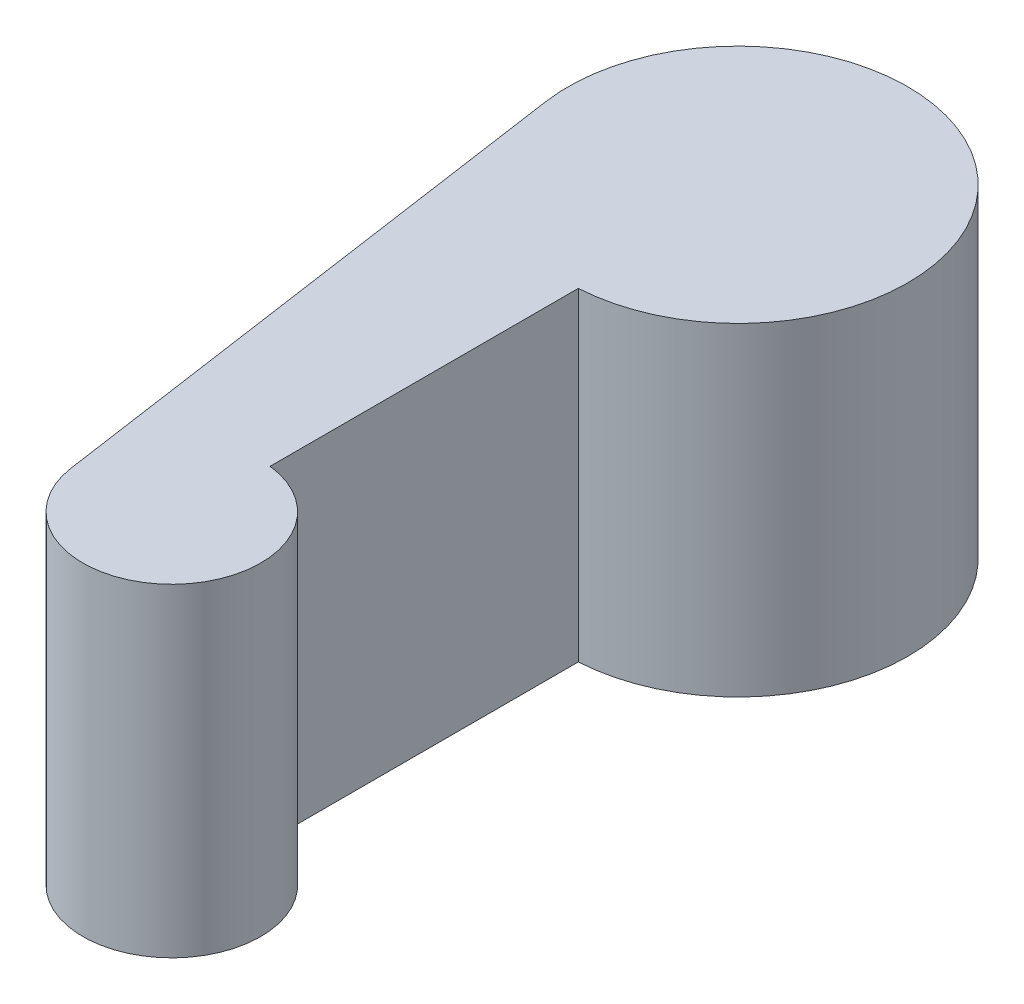
ISO-10303-21;
HEADER;
FILE_DESCRIPTION(('STEP AP214'),'2;1');
FILE_NAME('part.step','',(''),(''),'','','');
FILE_SCHEMA(('AUTOMOTIVE_DESIGN { 1 0 10303 214 1 1 1 1 }'));
ENDSEC;
DATA;
#1=APPLICATION_CONTEXT('core data for automotive mechanical design processes');
#2=APPLICATION_PROTOCOL_DEFINITION('international standard','automotive_design',2000,#1);
#3=PRODUCT_CONTEXT('',#1,'mechanical');
#4=PRODUCT('Part','Part','',(#3));
#5=PRODUCT_RELATED_PRODUCT_CATEGORY('part','',(#4));
#6=PRODUCT_DEFINITION_FORMATION('','',#4);
#7=PRODUCT_DEFINITION_CONTEXT('part definition',#1,'design');
#8=PRODUCT_DEFINITION('design','',#6,#7);
#9=PRODUCT_DEFINITION_SHAPE('','',#8);
#10=(LENGTH_UNIT() NAMED_UNIT(*) SI_UNIT(.MILLI.,.METRE.));
#11=(NAMED_UNIT(*) PLANE_ANGLE_UNIT() SI_UNIT($,.RADIAN.));
#12=(NAMED_UNIT(*) SI_UNIT($,.STERADIAN.) SOLID_ANGLE_UNIT());
#13=UNCERTAINTY_MEASURE_WITH_UNIT(LENGTH_MEASURE(1.E-05),#10,'distance_accuracy_value','');
#14=(GEOMETRIC_REPRESENTATION_CONTEXT(3) GLOBAL_UNCERTAINTY_ASSIGNED_CONTEXT((#13)) GLOBAL_UNIT_ASSIGNED_CONTEXT((#10,
#11,#12)) REPRESENTATION_CONTEXT('',''));
#15=CARTESIAN_POINT('',(0.,0.,0.));
#16=DIRECTION('',(0.,0.,1.));
#17=DIRECTION('',(1.,0.,0.));
#18=AXIS2_PLACEMENT_3D('',#15,#16,#17);
#19=CARTESIAN_POINT('',(-1.73743641369423,40.,-23.6707673501138));
#20=DIRECTION('',(0.,-1.,0.));
#21=DIRECTION('',(0.,0.,-1.));
#22=AXIS2_PLACEMENT_3D('',#19,#20,#21);
#23=CYLINDRICAL_SURFACE('',#22,21.);
#24=CARTESIAN_POINT('',(-1.73743641369423,0.,-23.6707673501138));
#25=DIRECTION('',(0.,1.,0.));
#26=DIRECTION('',(0.,0.,1.));
#27=AXIS2_PLACEMENT_3D('',#24,#25,#26);
#28=CIRCLE('',#27,21.);
#29=CARTESIAN_POINT('',(-0.517406688406153,0.,-2.70623712715362));
#30=VERTEX_POINT('',#29);
#31=CARTESIAN_POINT('',(-22.5220461045207,0.,-20.6707673501138));
#32=VERTEX_POINT('',#31);
#33=EDGE_CURVE('E101',#30,#32,#28,.T.);
#34=ORIENTED_EDGE('',*,*,#33,.T.);
#35=DIRECTION('',(0.,-1.,0.));
#36=VECTOR('',#35,1.);
#37=CARTESIAN_POINT('',(-22.5220461045207,40.,-20.6707673501138));
#38=LINE('',#37,#36);
#39=CARTESIAN_POINT('',(-22.5220461045207,40.,-20.6707673501138));
#40=VERTEX_POINT('',#39);
#41=EDGE_CURVE('E11',#40,#32,#38,.T.);
#42=ORIENTED_EDGE('',*,*,#41,.F.);
#43=CARTESIAN_POINT('',(-1.73743641369423,40.,-23.6707673501138));
#44=DIRECTION('',(0.,1.,0.));
#45=DIRECTION('',(0.,0.,1.));
#46=AXIS2_PLACEMENT_3D('',#43,#44,#45);
#47=CIRCLE('',#46,21.);
#48=CARTESIAN_POINT('',(-0.517406688406153,40.,-2.70623712715362));
#49=VERTEX_POINT('',#48);
#50=EDGE_CURVE('E78',#49,#40,#47,.T.);
#51=ORIENTED_EDGE('',*,*,#50,.F.);
#52=DIRECTION('',(0.,-1.,0.));
#53=VECTOR('',#52,1.);
#54=CARTESIAN_POINT('',(-0.517406688406153,40.,-2.70623712715362));
#55=LINE('',#54,#53);
#56=EDGE_CURVE('E53',#49,#30,#55,.T.);
#57=ORIENTED_EDGE('',*,*,#56,.T.);
#58=EDGE_LOOP('',(#34,#42,#51,#57));
#59=FACE_BOUND('',#58,.T.);
#60=ADVANCED_FACE('F37',(#59),#23,.T.);
#61=CARTESIAN_POINT('',(-19.1397333855033,40.,2.76258255558451));
#62=DIRECTION('',(-0.989743318610787,0.,0.142857142857143));
#63=DIRECTION('',(0.142857142857143,0.,0.989743318610787));
#64=AXIS2_PLACEMENT_3D('',#61,#62,#63);
#65=PLANE('',#64);
#66=DIRECTION('',(-0.142857142857143,0.,-0.989743318610787));
#67=VECTOR('',#66,1.);
#68=CARTESIAN_POINT('',(-19.1397333855033,0.,2.76258255558451));
#69=LINE('',#68,#67);
#70=CARTESIAN_POINT('',(-12.6246129184129,0.,47.9006612213146));
#71=VERTEX_POINT('',#70);
#72=EDGE_CURVE('E88',#71,#32,#69,.T.);
#73=ORIENTED_EDGE('',*,*,#72,.F.);
#74=DIRECTION('',(0.,-1.,0.));
#75=VECTOR('',#74,1.);
#76=CARTESIAN_POINT('',(-12.6246129184129,40.,47.9006612213146));
#77=LINE('',#76,#75);
#78=CARTESIAN_POINT('',(-12.6246129184129,40.,47.9006612213146));
#79=VERTEX_POINT('',#78);
#80=EDGE_CURVE('E45',#79,#71,#77,.T.);
#81=ORIENTED_EDGE('',*,*,#80,.F.);
#82=DIRECTION('',(-0.142857142857143,0.,-0.989743318610787));
#83=VECTOR('',#82,1.);
#84=CARTESIAN_POINT('',(-19.1397333855033,40.,2.76258255558451));
#85=LINE('',#84,#83);
#86=EDGE_CURVE('E86',#79,#40,#85,.T.);
#87=ORIENTED_EDGE('',*,*,#86,.T.);
#88=ORIENTED_EDGE('',*,*,#41,.T.);
#89=EDGE_LOOP('',(#73,#81,#87,#88));
#90=FACE_BOUND('',#89,.T.);
#91=ADVANCED_FACE('F85',(#90),#65,.T.);
#92=CARTESIAN_POINT('',(-1.73743641369423,40.,46.329232649886));
#93=DIRECTION('',(0.,-1.,0.));
#94=DIRECTION('',(0.,0.,-1.));
#95=AXIS2_PLACEMENT_3D('',#92,#93,#94);
#96=CYLINDRICAL_SURFACE('',#95,11.);
#97=CARTESIAN_POINT('',(-1.73743641369423,0.,46.329232649886));
#98=DIRECTION('',(0.,1.,0.));
#99=DIRECTION('',(0.,0.,1.));
#100=AXIS2_PLACEMENT_3D('',#97,#98,#99);
#101=CIRCLE('',#100,11.);
#102=CARTESIAN_POINT('',(-0.517406688406153,0.,35.3970998538844));
#103=VERTEX_POINT('',#102);
#104=EDGE_CURVE('E104',#71,#103,#101,.T.);
#105=ORIENTED_EDGE('',*,*,#104,.T.);
#106=DIRECTION('',(0.,-1.,0.));
#107=VECTOR('',#106,1.);
#108=CARTESIAN_POINT('',(-0.517406688406153,40.,35.3970998538844));
#109=LINE('',#108,#107);
#110=CARTESIAN_POINT('',(-0.517406688406153,40.,35.3970998538844));
#111=VERTEX_POINT('',#110);
#112=EDGE_CURVE('E67',#111,#103,#109,.T.);
#113=ORIENTED_EDGE('',*,*,#112,.F.);
#114=CARTESIAN_POINT('',(-1.73743641369423,40.,46.329232649886));
#115=DIRECTION('',(0.,1.,0.));
#116=DIRECTION('',(0.,0.,1.));
#117=AXIS2_PLACEMENT_3D('',#114,#115,#116);
#118=CIRCLE('',#117,11.);
#119=EDGE_CURVE('E91',#79,#111,#118,.T.);
#120=ORIENTED_EDGE('',*,*,#119,.F.);
#121=ORIENTED_EDGE('',*,*,#80,.T.);
#122=EDGE_LOOP('',(#105,#113,#120,#121));
#123=FACE_BOUND('',#122,.T.);
#124=ADVANCED_FACE('F92',(#123),#96,.T.);
#125=CARTESIAN_POINT('',(-0.517406688406153,40.,0.));
#126=DIRECTION('',(1.,0.,0.));
#127=DIRECTION('',(0.,0.,-1.));
#128=AXIS2_PLACEMENT_3D('',#125,#126,#127);
#129=PLANE('',#128);
#130=DIRECTION('',(0.,0.,1.));
#131=VECTOR('',#130,1.);
#132=CARTESIAN_POINT('',(-0.517406688406153,0.,0.));
#133=LINE('',#132,#131);
#134=EDGE_CURVE('E97',#30,#103,#133,.T.);
#135=ORIENTED_EDGE('',*,*,#134,.F.);
#136=ORIENTED_EDGE('',*,*,#56,.F.);
#137=DIRECTION('',(0.,0.,1.));
#138=VECTOR('',#137,1.);
#139=CARTESIAN_POINT('',(-0.517406688406153,40.,0.));
#140=LINE('',#139,#138);
#141=EDGE_CURVE('E93',#49,#111,#140,.T.);
#142=ORIENTED_EDGE('',*,*,#141,.T.);
#143=ORIENTED_EDGE('',*,*,#112,.T.);
#144=EDGE_LOOP('',(#135,#136,#142,#143));
#145=FACE_BOUND('',#144,.T.);
#146=ADVANCED_FACE('F111',(#145),#129,.T.);
#147=CARTESIAN_POINT('',(0.,40.,0.));
#148=DIRECTION('',(0.,1.,0.));
#149=DIRECTION('',(0.,0.,1.));
#150=AXIS2_PLACEMENT_3D('',#147,#148,#149);
#151=PLANE('',#150);
#152=ORIENTED_EDGE('',*,*,#50,.T.);
#153=ORIENTED_EDGE('',*,*,#86,.F.);
#154=ORIENTED_EDGE('',*,*,#119,.T.);
#155=ORIENTED_EDGE('',*,*,#141,.F.);
#156=EDGE_LOOP('',(#152,#153,#154,#155));
#157=FACE_BOUND('',#156,.T.);
#158=ADVANCED_FACE('F95',(#157),#151,.T.);
#159=CARTESIAN_POINT('',(0.,0.,0.));
#160=DIRECTION('',(0.,1.,0.));
#161=DIRECTION('',(0.,0.,1.));
#162=AXIS2_PLACEMENT_3D('',#159,#160,#161);
#163=PLANE('',#162);
#164=ORIENTED_EDGE('',*,*,#33,.F.);
#165=ORIENTED_EDGE('',*,*,#134,.T.);
#166=ORIENTED_EDGE('',*,*,#104,.F.);
#167=ORIENTED_EDGE('',*,*,#72,.T.);
#168=EDGE_LOOP('',(#164,#165,#166,#167));
#169=FACE_BOUND('',#168,.T.);
#170=ADVANCED_FACE('F110',(#169),#163,.F.);
#171=CLOSED_SHELL('',(#60,#91,#124,#146,#158,#170));
#172=MANIFOLD_SOLID_BREP('B2',#171);
#173=ADVANCED_BREP_SHAPE_REPRESENTATION('',(#18,#172),#14);
#174=SHAPE_DEFINITION_REPRESENTATION(#9,#173);
ENDSEC;
END-ISO-10303-21;
